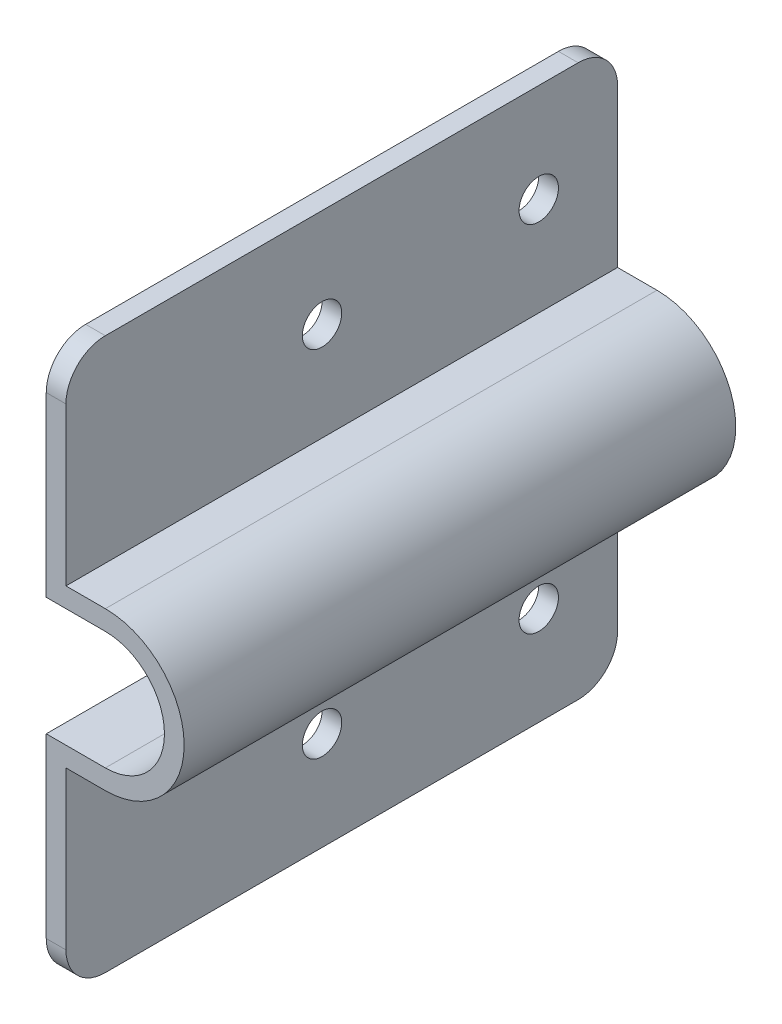
ISO-10303-21;
HEADER;
FILE_DESCRIPTION(('STEP AP214'),'2;1');
FILE_NAME('part.step','',(''),(''),'','','');
FILE_SCHEMA(('AUTOMOTIVE_DESIGN { 1 0 10303 214 1 1 1 1 }'));
ENDSEC;
DATA;
#1=APPLICATION_CONTEXT('core data for automotive mechanical design processes');
#2=APPLICATION_PROTOCOL_DEFINITION('international standard','automotive_design',2000,#1);
#3=PRODUCT_CONTEXT('',#1,'mechanical');
#4=PRODUCT('Part','Part','',(#3));
#5=PRODUCT_RELATED_PRODUCT_CATEGORY('part','',(#4));
#6=PRODUCT_DEFINITION_FORMATION('','',#4);
#7=PRODUCT_DEFINITION_CONTEXT('part definition',#1,'design');
#8=PRODUCT_DEFINITION('design','',#6,#7);
#9=PRODUCT_DEFINITION_SHAPE('','',#8);
#10=(LENGTH_UNIT() NAMED_UNIT(*) SI_UNIT(.MILLI.,.METRE.));
#11=(NAMED_UNIT(*) PLANE_ANGLE_UNIT() SI_UNIT($,.RADIAN.));
#12=(NAMED_UNIT(*) SI_UNIT($,.STERADIAN.) SOLID_ANGLE_UNIT());
#13=UNCERTAINTY_MEASURE_WITH_UNIT(LENGTH_MEASURE(1.E-05),#10,'distance_accuracy_value','');
#14=(GEOMETRIC_REPRESENTATION_CONTEXT(3) GLOBAL_UNCERTAINTY_ASSIGNED_CONTEXT((#13)) GLOBAL_UNIT_ASSIGNED_CONTEXT((#10,
#11,#12)) REPRESENTATION_CONTEXT('',''));
#15=CARTESIAN_POINT('',(0.,0.,0.));
#16=DIRECTION('',(0.,0.,1.));
#17=DIRECTION('',(1.,0.,0.));
#18=AXIS2_PLACEMENT_3D('',#15,#16,#17);
#19=CARTESIAN_POINT('',(0.,288.164397321974,-88.9));
#20=DIRECTION('',(0.,1.,0.));
#21=DIRECTION('',(0.,0.,1.));
#22=AXIS2_PLACEMENT_3D('',#19,#20,#21);
#23=PLANE('',#22);
#24=DIRECTION('',(-1.,0.,0.));
#25=VECTOR('',#24,1.);
#26=CARTESIAN_POINT('',(0.,288.164397321974,0.));
#27=LINE('',#26,#25);
#28=CARTESIAN_POINT('',(19.6849999999996,288.164397321974,0.));
#29=VERTEX_POINT('',#28);
#30=CARTESIAN_POINT('',(10.1599999999996,288.164397321974,0.));
#31=VERTEX_POINT('',#30);
#32=EDGE_CURVE('E223',#29,#31,#27,.T.);
#33=ORIENTED_EDGE('',*,*,#32,.T.);
#34=DIRECTION('',(0.,0.,1.));
#35=VECTOR('',#34,1.);
#36=CARTESIAN_POINT('',(10.1599999999996,288.164397321974,-88.9));
#37=LINE('',#36,#35);
#38=CARTESIAN_POINT('',(10.1599999999996,288.164397321974,-88.9));
#39=VERTEX_POINT('',#38);
#40=EDGE_CURVE('E184',#39,#31,#37,.T.);
#41=ORIENTED_EDGE('',*,*,#40,.F.);
#42=DIRECTION('',(-1.,0.,0.));
#43=VECTOR('',#42,1.);
#44=CARTESIAN_POINT('',(0.,288.164397321974,-88.9));
#45=LINE('',#44,#43);
#46=CARTESIAN_POINT('',(19.6849999999996,288.164397321974,-88.9));
#47=VERTEX_POINT('',#46);
#48=EDGE_CURVE('E163',#47,#39,#45,.T.);
#49=ORIENTED_EDGE('',*,*,#48,.F.);
#50=DIRECTION('',(0.,0.,1.));
#51=VECTOR('',#50,1.);
#52=CARTESIAN_POINT('',(19.6849999999996,288.164397321974,-88.9));
#53=LINE('',#52,#51);
#54=EDGE_CURVE('E172',#47,#29,#53,.T.);
#55=ORIENTED_EDGE('',*,*,#54,.T.);
#56=EDGE_LOOP('',(#33,#41,#49,#55));
#57=FACE_BOUND('',#56,.T.);
#58=ADVANCED_FACE('F42',(#57),#23,.F.);
#59=CARTESIAN_POINT('',(10.1599999999996,0.,-88.9));
#60=DIRECTION('',(-1.,0.,0.));
#61=DIRECTION('',(0.,-1.,0.));
#62=AXIS2_PLACEMENT_3D('',#59,#60,#61);
#63=PLANE('',#62);
#64=CARTESIAN_POINT('',(10.1599999999996,307.214397321974,-41.275));
#65=DIRECTION('',(1.,0.,0.));
#66=DIRECTION('',(0.,0.,-1.));
#67=AXIS2_PLACEMENT_3D('',#64,#65,#66);
#68=CIRCLE('',#67,3.175);
#69=CARTESIAN_POINT('',(10.1599999999996,307.214397321974,-44.45));
#70=VERTEX_POINT('',#69);
#71=EDGE_CURVE('E652',#70,#70,#68,.T.);
#72=ORIENTED_EDGE('',*,*,#71,.T.);
#73=EDGE_LOOP('',(#72));
#74=FACE_BOUND('',#73,.T.);
#75=CARTESIAN_POINT('',(10.1599999999996,307.214397321974,-76.2));
#76=DIRECTION('',(1.,0.,0.));
#77=DIRECTION('',(0.,0.,-1.));
#78=AXIS2_PLACEMENT_3D('',#75,#76,#77);
#79=CIRCLE('',#78,3.175);
#80=CARTESIAN_POINT('',(10.1599999999996,307.214397321974,-79.375));
#81=VERTEX_POINT('',#80);
#82=EDGE_CURVE('E651',#81,#81,#79,.T.);
#83=ORIENTED_EDGE('',*,*,#82,.T.);
#84=EDGE_LOOP('',(#83));
#85=FACE_BOUND('',#84,.T.);
#86=DIRECTION('',(0.,-1.,0.));
#87=VECTOR('',#86,1.);
#88=CARTESIAN_POINT('',(10.1599999999996,0.,0.));
#89=LINE('',#88,#87);
#90=CARTESIAN_POINT('',(10.1599999999996,316.739397321974,0.));
#91=VERTEX_POINT('',#90);
#92=EDGE_CURVE('E186',#91,#31,#89,.T.);
#93=ORIENTED_EDGE('',*,*,#92,.F.);
#94=CARTESIAN_POINT('',(10.1599999999996,316.739397321974,-6.34999999999999));
#95=DIRECTION('',(-1.,0.,0.));
#96=DIRECTION('',(0.,-1.,0.));
#97=AXIS2_PLACEMENT_3D('',#94,#95,#96);
#98=CIRCLE('',#97,6.35);
#99=CARTESIAN_POINT('',(10.1599999999996,323.089397321974,-6.34999999999999));
#100=VERTEX_POINT('',#99);
#101=EDGE_CURVE('E11',#91,#100,#98,.T.);
#102=ORIENTED_EDGE('',*,*,#101,.T.);
#103=DIRECTION('',(0.,0.,1.));
#104=VECTOR('',#103,1.);
#105=CARTESIAN_POINT('',(10.1599999999996,323.089397321974,-88.9));
#106=LINE('',#105,#104);
#107=CARTESIAN_POINT('',(10.1599999999996,323.089397321974,-82.55));
#108=VERTEX_POINT('',#107);
#109=EDGE_CURVE('E258',#108,#100,#106,.T.);
#110=ORIENTED_EDGE('',*,*,#109,.F.);
#111=CARTESIAN_POINT('',(10.1599999999996,316.739397321974,-82.55));
#112=DIRECTION('',(-1.,0.,0.));
#113=DIRECTION('',(0.,-1.,0.));
#114=AXIS2_PLACEMENT_3D('',#111,#112,#113);
#115=CIRCLE('',#114,6.35);
#116=CARTESIAN_POINT('',(10.1599999999996,316.739397321974,-88.9));
#117=VERTEX_POINT('',#116);
#118=EDGE_CURVE('E51',#108,#117,#115,.T.);
#119=ORIENTED_EDGE('',*,*,#118,.T.);
#120=DIRECTION('',(0.,-1.,0.));
#121=VECTOR('',#120,1.);
#122=CARTESIAN_POINT('',(10.1599999999996,0.,-88.9));
#123=LINE('',#122,#121);
#124=EDGE_CURVE('E181',#117,#39,#123,.T.);
#125=ORIENTED_EDGE('',*,*,#124,.T.);
#126=ORIENTED_EDGE('',*,*,#40,.T.);
#127=EDGE_LOOP('',(#93,#102,#110,#119,#125,#126));
#128=FACE_BOUND('',#127,.T.);
#129=ADVANCED_FACE('F336',(#74,#85,#128),#63,.T.);
#130=CARTESIAN_POINT('',(0.,323.089397321974,-88.9));
#131=DIRECTION('',(0.,-1.,0.));
#132=DIRECTION('',(0.,0.,-1.));
#133=AXIS2_PLACEMENT_3D('',#130,#131,#132);
#134=PLANE('',#133);
#135=ORIENTED_EDGE('',*,*,#109,.T.);
#136=DIRECTION('',(1.,0.,0.));
#137=VECTOR('',#136,1.);
#138=CARTESIAN_POINT('',(13.3349999999996,323.089397321974,-6.34999999999999));
#139=LINE('',#138,#137);
#140=CARTESIAN_POINT('',(13.3349999999996,323.089397321974,-6.34999999999999));
#141=VERTEX_POINT('',#140);
#142=EDGE_CURVE('E325',#100,#141,#139,.T.);
#143=ORIENTED_EDGE('',*,*,#142,.T.);
#144=DIRECTION('',(0.,0.,1.));
#145=VECTOR('',#144,1.);
#146=CARTESIAN_POINT('',(13.3349999999996,323.089397321974,-88.9));
#147=LINE('',#146,#145);
#148=CARTESIAN_POINT('',(13.3349999999996,323.089397321974,-82.55));
#149=VERTEX_POINT('',#148);
#150=EDGE_CURVE('E261',#149,#141,#147,.T.);
#151=ORIENTED_EDGE('',*,*,#150,.F.);
#152=DIRECTION('',(1.,0.,0.));
#153=VECTOR('',#152,1.);
#154=CARTESIAN_POINT('',(0.,323.089397321974,-82.55));
#155=LINE('',#154,#153);
#156=EDGE_CURVE('E63',#149,#108,#155,.F.);
#157=ORIENTED_EDGE('',*,*,#156,.T.);
#158=EDGE_LOOP('',(#135,#143,#151,#157));
#159=FACE_BOUND('',#158,.T.);
#160=ADVANCED_FACE('F342',(#159),#134,.F.);
#161=CARTESIAN_POINT('',(13.3349999999996,0.,-88.9));
#162=DIRECTION('',(1.,0.,0.));
#163=DIRECTION('',(0.,0.,-1.));
#164=AXIS2_PLACEMENT_3D('',#161,#162,#163);
#165=PLANE('',#164);
#166=CARTESIAN_POINT('',(13.3349999999996,307.214397321974,-41.275));
#167=DIRECTION('',(1.,0.,0.));
#168=DIRECTION('',(0.,0.,-1.));
#169=AXIS2_PLACEMENT_3D('',#166,#167,#168);
#170=CIRCLE('',#169,3.175);
#171=CARTESIAN_POINT('',(13.3349999999996,307.214397321974,-44.45));
#172=VERTEX_POINT('',#171);
#173=EDGE_CURVE('E645',#172,#172,#170,.T.);
#174=ORIENTED_EDGE('',*,*,#173,.F.);
#175=EDGE_LOOP('',(#174));
#176=FACE_BOUND('',#175,.T.);
#177=CARTESIAN_POINT('',(13.3349999999996,307.214397321974,-76.2));
#178=DIRECTION('',(1.,0.,0.));
#179=DIRECTION('',(0.,0.,-1.));
#180=AXIS2_PLACEMENT_3D('',#177,#178,#179);
#181=CIRCLE('',#180,3.175);
#182=CARTESIAN_POINT('',(13.3349999999996,307.214397321974,-79.375));
#183=VERTEX_POINT('',#182);
#184=EDGE_CURVE('E648',#183,#183,#181,.T.);
#185=ORIENTED_EDGE('',*,*,#184,.F.);
#186=EDGE_LOOP('',(#185));
#187=FACE_BOUND('',#186,.T.);
#188=ORIENTED_EDGE('',*,*,#150,.T.);
#189=CARTESIAN_POINT('',(13.3349999999996,316.739397321974,-6.34999999999999));
#190=DIRECTION('',(1.,0.,0.));
#191=DIRECTION('',(0.,0.,-1.));
#192=AXIS2_PLACEMENT_3D('',#189,#190,#191);
#193=CIRCLE('',#192,6.35);
#194=CARTESIAN_POINT('',(13.3349999999996,316.739397321974,0.));
#195=VERTEX_POINT('',#194);
#196=EDGE_CURVE('E331',#141,#195,#193,.T.);
#197=ORIENTED_EDGE('',*,*,#196,.T.);
#198=DIRECTION('',(0.,1.,0.));
#199=VECTOR('',#198,1.);
#200=CARTESIAN_POINT('',(13.3349999999996,0.,0.));
#201=LINE('',#200,#199);
#202=CARTESIAN_POINT('',(13.3349999999996,291.339397321974,0.));
#203=VERTEX_POINT('',#202);
#204=EDGE_CURVE('E190',#203,#195,#201,.T.);
#205=ORIENTED_EDGE('',*,*,#204,.F.);
#206=DIRECTION('',(0.,0.,1.));
#207=VECTOR('',#206,1.);
#208=CARTESIAN_POINT('',(13.3349999999996,291.339397321974,-88.9));
#209=LINE('',#208,#207);
#210=CARTESIAN_POINT('',(13.3349999999996,291.339397321974,-88.9));
#211=VERTEX_POINT('',#210);
#212=EDGE_CURVE('E265',#211,#203,#209,.T.);
#213=ORIENTED_EDGE('',*,*,#212,.F.);
#214=DIRECTION('',(0.,1.,0.));
#215=VECTOR('',#214,1.);
#216=CARTESIAN_POINT('',(13.3349999999996,0.,-88.9));
#217=LINE('',#216,#215);
#218=CARTESIAN_POINT('',(13.3349999999996,316.739397321974,-88.9));
#219=VERTEX_POINT('',#218);
#220=EDGE_CURVE('E217',#211,#219,#217,.T.);
#221=ORIENTED_EDGE('',*,*,#220,.T.);
#222=CARTESIAN_POINT('',(13.3349999999996,316.739397321974,-82.55));
#223=DIRECTION('',(1.,0.,0.));
#224=DIRECTION('',(0.,0.,-1.));
#225=AXIS2_PLACEMENT_3D('',#222,#223,#224);
#226=CIRCLE('',#225,6.35);
#227=EDGE_CURVE('E328',#219,#149,#226,.T.);
#228=ORIENTED_EDGE('',*,*,#227,.T.);
#229=EDGE_LOOP('',(#188,#197,#205,#213,#221,#228));
#230=FACE_BOUND('',#229,.T.);
#231=ADVANCED_FACE('F341',(#176,#187,#230),#165,.T.);
#232=CARTESIAN_POINT('',(0.,291.339397321974,-88.9));
#233=DIRECTION('',(0.,1.,0.));
#234=DIRECTION('',(0.,0.,1.));
#235=AXIS2_PLACEMENT_3D('',#232,#233,#234);
#236=PLANE('',#235);
#237=DIRECTION('',(-1.,0.,0.));
#238=VECTOR('',#237,1.);
#239=CARTESIAN_POINT('',(0.,291.339397321974,0.));
#240=LINE('',#239,#238);
#241=CARTESIAN_POINT('',(19.6849999999996,291.339397321974,0.));
#242=VERTEX_POINT('',#241);
#243=EDGE_CURVE('E248',#242,#203,#240,.T.);
#244=ORIENTED_EDGE('',*,*,#243,.F.);
#245=DIRECTION('',(0.,0.,1.));
#246=VECTOR('',#245,1.);
#247=CARTESIAN_POINT('',(19.6849999999996,291.339397321974,-88.9));
#248=LINE('',#247,#246);
#249=CARTESIAN_POINT('',(19.6849999999996,291.339397321974,-88.9));
#250=VERTEX_POINT('',#249);
#251=EDGE_CURVE('E268',#250,#242,#248,.T.);
#252=ORIENTED_EDGE('',*,*,#251,.F.);
#253=DIRECTION('',(-1.,0.,0.));
#254=VECTOR('',#253,1.);
#255=CARTESIAN_POINT('',(0.,291.339397321974,-88.9));
#256=LINE('',#255,#254);
#257=EDGE_CURVE('E213',#250,#211,#256,.T.);
#258=ORIENTED_EDGE('',*,*,#257,.T.);
#259=ORIENTED_EDGE('',*,*,#212,.T.);
#260=EDGE_LOOP('',(#244,#252,#258,#259));
#261=FACE_BOUND('',#260,.T.);
#262=ADVANCED_FACE('F354',(#261),#236,.T.);
#263=CARTESIAN_POINT('',(19.6849999999996,278.639397321974,-88.9));
#264=DIRECTION('',(0.,0.,1.));
#265=DIRECTION('',(1.,0.,0.));
#266=AXIS2_PLACEMENT_3D('',#263,#264,#265);
#267=CYLINDRICAL_SURFACE('',#266,12.7);
#268=CARTESIAN_POINT('',(19.6849999999996,278.639397321974,0.));
#269=DIRECTION('',(0.,0.,1.));
#270=DIRECTION('',(1.,0.,0.));
#271=AXIS2_PLACEMENT_3D('',#268,#269,#270);
#272=CIRCLE('',#271,12.7);
#273=CARTESIAN_POINT('',(19.6849999999996,265.939397321974,0.));
#274=VERTEX_POINT('',#273);
#275=EDGE_CURVE('E244',#274,#242,#272,.T.);
#276=ORIENTED_EDGE('',*,*,#275,.F.);
#277=DIRECTION('',(0.,0.,1.));
#278=VECTOR('',#277,1.);
#279=CARTESIAN_POINT('',(19.6849999999996,265.939397321974,-88.9));
#280=LINE('',#279,#278);
#281=CARTESIAN_POINT('',(19.6849999999996,265.939397321974,-88.9));
#282=VERTEX_POINT('',#281);
#283=EDGE_CURVE('E271',#282,#274,#280,.T.);
#284=ORIENTED_EDGE('',*,*,#283,.F.);
#285=CARTESIAN_POINT('',(19.6849999999996,278.639397321974,-88.9));
#286=DIRECTION('',(0.,0.,1.));
#287=DIRECTION('',(1.,0.,0.));
#288=AXIS2_PLACEMENT_3D('',#285,#286,#287);
#289=CIRCLE('',#288,12.7);
#290=EDGE_CURVE('E209',#282,#250,#289,.T.);
#291=ORIENTED_EDGE('',*,*,#290,.T.);
#292=ORIENTED_EDGE('',*,*,#251,.T.);
#293=EDGE_LOOP('',(#276,#284,#291,#292));
#294=FACE_BOUND('',#293,.T.);
#295=ADVANCED_FACE('F358',(#294),#267,.T.);
#296=CARTESIAN_POINT('',(0.,265.939397321974,-88.9));
#297=DIRECTION('',(0.,1.,0.));
#298=DIRECTION('',(0.,0.,1.));
#299=AXIS2_PLACEMENT_3D('',#296,#297,#298);
#300=PLANE('',#299);
#301=DIRECTION('',(-1.,0.,0.));
#302=VECTOR('',#301,1.);
#303=CARTESIAN_POINT('',(0.,265.939397321974,0.));
#304=LINE('',#303,#302);
#305=CARTESIAN_POINT('',(13.3349999999996,265.939397321974,0.));
#306=VERTEX_POINT('',#305);
#307=EDGE_CURVE('E240',#274,#306,#304,.T.);
#308=ORIENTED_EDGE('',*,*,#307,.T.);
#309=DIRECTION('',(0.,0.,1.));
#310=VECTOR('',#309,1.);
#311=CARTESIAN_POINT('',(13.3349999999996,265.939397321974,-88.9));
#312=LINE('',#311,#310);
#313=CARTESIAN_POINT('',(13.3349999999996,265.939397321974,-88.9));
#314=VERTEX_POINT('',#313);
#315=EDGE_CURVE('E274',#314,#306,#312,.T.);
#316=ORIENTED_EDGE('',*,*,#315,.F.);
#317=DIRECTION('',(-1.,0.,0.));
#318=VECTOR('',#317,1.);
#319=CARTESIAN_POINT('',(0.,265.939397321974,-88.9));
#320=LINE('',#319,#318);
#321=EDGE_CURVE('E205',#282,#314,#320,.T.);
#322=ORIENTED_EDGE('',*,*,#321,.F.);
#323=ORIENTED_EDGE('',*,*,#283,.T.);
#324=EDGE_LOOP('',(#308,#316,#322,#323));
#325=FACE_BOUND('',#324,.T.);
#326=ADVANCED_FACE('F362',(#325),#300,.F.);
#327=CARTESIAN_POINT('',(13.3349999999996,0.,-88.9));
#328=DIRECTION('',(1.,0.,0.));
#329=DIRECTION('',(0.,0.,-1.));
#330=AXIS2_PLACEMENT_3D('',#327,#328,#329);
#331=PLANE('',#330);
#332=CARTESIAN_POINT('',(13.3349999999996,250.064397321974,-76.2));
#333=DIRECTION('',(1.,0.,0.));
#334=DIRECTION('',(0.,0.,-1.));
#335=AXIS2_PLACEMENT_3D('',#332,#333,#334);
#336=CIRCLE('',#335,3.175);
#337=CARTESIAN_POINT('',(13.3349999999996,250.064397321974,-79.375));
#338=VERTEX_POINT('',#337);
#339=EDGE_CURVE('E656',#338,#338,#336,.T.);
#340=ORIENTED_EDGE('',*,*,#339,.F.);
#341=EDGE_LOOP('',(#340));
#342=FACE_BOUND('',#341,.T.);
#343=CARTESIAN_POINT('',(13.3349999999996,250.064397321974,-41.275));
#344=DIRECTION('',(1.,0.,0.));
#345=DIRECTION('',(0.,0.,-1.));
#346=AXIS2_PLACEMENT_3D('',#343,#344,#345);
#347=CIRCLE('',#346,3.175);
#348=CARTESIAN_POINT('',(13.3349999999996,250.064397321974,-44.45));
#349=VERTEX_POINT('',#348);
#350=EDGE_CURVE('E193',#349,#349,#347,.T.);
#351=ORIENTED_EDGE('',*,*,#350,.F.);
#352=EDGE_LOOP('',(#351));
#353=FACE_BOUND('',#352,.T.);
#354=DIRECTION('',(0.,1.,0.));
#355=VECTOR('',#354,1.);
#356=CARTESIAN_POINT('',(13.3349999999996,0.,0.));
#357=LINE('',#356,#355);
#358=CARTESIAN_POINT('',(13.3349999999996,240.539397321974,0.));
#359=VERTEX_POINT('',#358);
#360=EDGE_CURVE('E237',#359,#306,#357,.T.);
#361=ORIENTED_EDGE('',*,*,#360,.F.);
#362=CARTESIAN_POINT('',(13.3349999999996,240.539397321974,-6.35));
#363=DIRECTION('',(1.,0.,0.));
#364=DIRECTION('',(0.,0.,-1.));
#365=AXIS2_PLACEMENT_3D('',#362,#363,#364);
#366=CIRCLE('',#365,6.35);
#367=CARTESIAN_POINT('',(13.3349999999996,234.189397321974,-6.34999999999999));
#368=VERTEX_POINT('',#367);
#369=EDGE_CURVE('E300',#359,#368,#366,.T.);
#370=ORIENTED_EDGE('',*,*,#369,.T.);
#371=DIRECTION('',(0.,0.,1.));
#372=VECTOR('',#371,1.);
#373=CARTESIAN_POINT('',(13.3349999999996,234.189397321974,-88.9));
#374=LINE('',#373,#372);
#375=CARTESIAN_POINT('',(13.3349999999996,234.189397321974,-82.55));
#376=VERTEX_POINT('',#375);
#377=EDGE_CURVE('E278',#376,#368,#374,.T.);
#378=ORIENTED_EDGE('',*,*,#377,.F.);
#379=CARTESIAN_POINT('',(13.3349999999996,240.539397321974,-82.55));
#380=DIRECTION('',(1.,0.,0.));
#381=DIRECTION('',(0.,0.,-1.));
#382=AXIS2_PLACEMENT_3D('',#379,#380,#381);
#383=CIRCLE('',#382,6.35);
#384=CARTESIAN_POINT('',(13.3349999999996,240.539397321974,-88.9));
#385=VERTEX_POINT('',#384);
#386=EDGE_CURVE('E297',#376,#385,#383,.T.);
#387=ORIENTED_EDGE('',*,*,#386,.T.);
#388=DIRECTION('',(0.,1.,0.));
#389=VECTOR('',#388,1.);
#390=CARTESIAN_POINT('',(13.3349999999996,0.,-88.9));
#391=LINE('',#390,#389);
#392=EDGE_CURVE('E202',#385,#314,#391,.T.);
#393=ORIENTED_EDGE('',*,*,#392,.T.);
#394=ORIENTED_EDGE('',*,*,#315,.T.);
#395=EDGE_LOOP('',(#361,#370,#378,#387,#393,#394));
#396=FACE_BOUND('',#395,.T.);
#397=ADVANCED_FACE('F496',(#342,#353,#396),#331,.T.);
#398=CARTESIAN_POINT('',(0.,234.189397321974,-88.9));
#399=DIRECTION('',(0.,-1.,0.));
#400=DIRECTION('',(0.,0.,-1.));
#401=AXIS2_PLACEMENT_3D('',#398,#399,#400);
#402=PLANE('',#401);
#403=ORIENTED_EDGE('',*,*,#377,.T.);
#404=DIRECTION('',(1.,0.,0.));
#405=VECTOR('',#404,1.);
#406=CARTESIAN_POINT('',(0.,234.189397321974,-6.34999999999999));
#407=LINE('',#406,#405);
#408=CARTESIAN_POINT('',(10.1599999999996,234.189397321974,-6.34999999999999));
#409=VERTEX_POINT('',#408);
#410=EDGE_CURVE('E307',#368,#409,#407,.F.);
#411=ORIENTED_EDGE('',*,*,#410,.T.);
#412=DIRECTION('',(0.,0.,1.));
#413=VECTOR('',#412,1.);
#414=CARTESIAN_POINT('',(10.1599999999996,234.189397321974,-88.9));
#415=LINE('',#414,#413);
#416=CARTESIAN_POINT('',(10.1599999999996,234.189397321974,-82.55));
#417=VERTEX_POINT('',#416);
#418=EDGE_CURVE('E282',#417,#409,#415,.T.);
#419=ORIENTED_EDGE('',*,*,#418,.F.);
#420=DIRECTION('',(1.,0.,0.));
#421=VECTOR('',#420,1.);
#422=CARTESIAN_POINT('',(13.3349999999996,234.189397321974,-82.55));
#423=LINE('',#422,#421);
#424=EDGE_CURVE('E303',#417,#376,#423,.T.);
#425=ORIENTED_EDGE('',*,*,#424,.T.);
#426=EDGE_LOOP('',(#403,#411,#419,#425));
#427=FACE_BOUND('',#426,.T.);
#428=ADVANCED_FACE('F374',(#427),#402,.T.);
#429=CARTESIAN_POINT('',(10.1599999999996,0.,-88.9));
#430=DIRECTION('',(-1.,0.,0.));
#431=DIRECTION('',(0.,-1.,0.));
#432=AXIS2_PLACEMENT_3D('',#429,#430,#431);
#433=PLANE('',#432);
#434=CARTESIAN_POINT('',(10.1599999999996,250.064397321974,-76.2));
#435=DIRECTION('',(1.,0.,0.));
#436=DIRECTION('',(0.,0.,-1.));
#437=AXIS2_PLACEMENT_3D('',#434,#435,#436);
#438=CIRCLE('',#437,3.175);
#439=CARTESIAN_POINT('',(10.1599999999996,250.064397321974,-79.375));
#440=VERTEX_POINT('',#439);
#441=EDGE_CURVE('E671',#440,#440,#438,.T.);
#442=ORIENTED_EDGE('',*,*,#441,.T.);
#443=EDGE_LOOP('',(#442));
#444=FACE_BOUND('',#443,.T.);
#445=CARTESIAN_POINT('',(10.1599999999996,250.064397321974,-41.275));
#446=DIRECTION('',(1.,0.,0.));
#447=DIRECTION('',(0.,0.,-1.));
#448=AXIS2_PLACEMENT_3D('',#445,#446,#447);
#449=CIRCLE('',#448,3.175);
#450=CARTESIAN_POINT('',(10.1599999999996,250.064397321974,-44.45));
#451=VERTEX_POINT('',#450);
#452=EDGE_CURVE('E226',#451,#451,#449,.T.);
#453=ORIENTED_EDGE('',*,*,#452,.T.);
#454=EDGE_LOOP('',(#453));
#455=FACE_BOUND('',#454,.T.);
#456=ORIENTED_EDGE('',*,*,#418,.T.);
#457=CARTESIAN_POINT('',(10.1599999999996,240.539397321974,-6.35));
#458=DIRECTION('',(-1.,0.,0.));
#459=DIRECTION('',(0.,-1.,0.));
#460=AXIS2_PLACEMENT_3D('',#457,#458,#459);
#461=CIRCLE('',#460,6.35);
#462=CARTESIAN_POINT('',(10.1599999999996,240.539397321974,0.));
#463=VERTEX_POINT('',#462);
#464=EDGE_CURVE('E313',#409,#463,#461,.T.);
#465=ORIENTED_EDGE('',*,*,#464,.T.);
#466=DIRECTION('',(0.,-1.,0.));
#467=VECTOR('',#466,1.);
#468=CARTESIAN_POINT('',(10.1599999999996,0.,0.));
#469=LINE('',#468,#467);
#470=CARTESIAN_POINT('',(10.1599999999996,269.114397321974,0.));
#471=VERTEX_POINT('',#470);
#472=EDGE_CURVE('E233',#471,#463,#469,.T.);
#473=ORIENTED_EDGE('',*,*,#472,.F.);
#474=DIRECTION('',(0.,0.,1.));
#475=VECTOR('',#474,1.);
#476=CARTESIAN_POINT('',(10.1599999999996,269.114397321974,-88.9));
#477=LINE('',#476,#475);
#478=CARTESIAN_POINT('',(10.1599999999996,269.114397321974,-88.9));
#479=VERTEX_POINT('',#478);
#480=EDGE_CURVE('E286',#479,#471,#477,.T.);
#481=ORIENTED_EDGE('',*,*,#480,.F.);
#482=DIRECTION('',(0.,-1.,0.));
#483=VECTOR('',#482,1.);
#484=CARTESIAN_POINT('',(10.1599999999996,0.,-88.9));
#485=LINE('',#484,#483);
#486=CARTESIAN_POINT('',(10.1599999999996,240.539397321974,-88.9));
#487=VERTEX_POINT('',#486);
#488=EDGE_CURVE('E198',#479,#487,#485,.T.);
#489=ORIENTED_EDGE('',*,*,#488,.T.);
#490=CARTESIAN_POINT('',(10.1599999999996,240.539397321974,-82.55));
#491=DIRECTION('',(-1.,0.,0.));
#492=DIRECTION('',(0.,-1.,0.));
#493=AXIS2_PLACEMENT_3D('',#490,#491,#492);
#494=CIRCLE('',#493,6.35);
#495=EDGE_CURVE('E310',#487,#417,#494,.T.);
#496=ORIENTED_EDGE('',*,*,#495,.T.);
#497=EDGE_LOOP('',(#456,#465,#473,#481,#489,#496));
#498=FACE_BOUND('',#497,.T.);
#499=ADVANCED_FACE('F371',(#444,#455,#498),#433,.T.);
#500=CARTESIAN_POINT('',(0.,269.114397321974,-88.9));
#501=DIRECTION('',(0.,1.,0.));
#502=DIRECTION('',(0.,0.,1.));
#503=AXIS2_PLACEMENT_3D('',#500,#501,#502);
#504=PLANE('',#503);
#505=DIRECTION('',(-1.,0.,0.));
#506=VECTOR('',#505,1.);
#507=CARTESIAN_POINT('',(0.,269.114397321974,0.));
#508=LINE('',#507,#506);
#509=CARTESIAN_POINT('',(19.6849999999996,269.114397321974,0.));
#510=VERTEX_POINT('',#509);
#511=EDGE_CURVE('E229',#510,#471,#508,.T.);
#512=ORIENTED_EDGE('',*,*,#511,.F.);
#513=DIRECTION('',(0.,0.,1.));
#514=VECTOR('',#513,1.);
#515=CARTESIAN_POINT('',(19.6849999999996,269.114397321974,-88.9));
#516=LINE('',#515,#514);
#517=CARTESIAN_POINT('',(19.6849999999996,269.114397321974,-88.9));
#518=VERTEX_POINT('',#517);
#519=EDGE_CURVE('E180',#518,#510,#516,.T.);
#520=ORIENTED_EDGE('',*,*,#519,.F.);
#521=DIRECTION('',(-1.,0.,0.));
#522=VECTOR('',#521,1.);
#523=CARTESIAN_POINT('',(0.,269.114397321974,-88.9));
#524=LINE('',#523,#522);
#525=EDGE_CURVE('E167',#518,#479,#524,.T.);
#526=ORIENTED_EDGE('',*,*,#525,.T.);
#527=ORIENTED_EDGE('',*,*,#480,.T.);
#528=EDGE_LOOP('',(#512,#520,#526,#527));
#529=FACE_BOUND('',#528,.T.);
#530=ADVANCED_FACE('F384',(#529),#504,.T.);
#531=CARTESIAN_POINT('',(19.6849999999996,278.639397321974,-88.9));
#532=DIRECTION('',(0.,0.,1.));
#533=DIRECTION('',(1.,0.,0.));
#534=AXIS2_PLACEMENT_3D('',#531,#532,#533);
#535=CYLINDRICAL_SURFACE('',#534,9.525);
#536=CARTESIAN_POINT('',(19.6849999999996,278.639397321974,0.));
#537=DIRECTION('',(0.,0.,1.));
#538=DIRECTION('',(1.,0.,0.));
#539=AXIS2_PLACEMENT_3D('',#536,#537,#538);
#540=CIRCLE('',#539,9.525);
#541=EDGE_CURVE('E175',#510,#29,#540,.T.);
#542=ORIENTED_EDGE('',*,*,#541,.T.);
#543=ORIENTED_EDGE('',*,*,#54,.F.);
#544=CARTESIAN_POINT('',(19.6849999999996,278.639397321974,-88.9));
#545=DIRECTION('',(0.,0.,1.));
#546=DIRECTION('',(1.,0.,0.));
#547=AXIS2_PLACEMENT_3D('',#544,#545,#546);
#548=CIRCLE('',#547,9.525);
#549=EDGE_CURVE('E157',#518,#47,#548,.T.);
#550=ORIENTED_EDGE('',*,*,#549,.F.);
#551=ORIENTED_EDGE('',*,*,#519,.T.);
#552=EDGE_LOOP('',(#542,#543,#550,#551));
#553=FACE_BOUND('',#552,.T.);
#554=ADVANCED_FACE('F173',(#553),#535,.F.);
#555=CARTESIAN_POINT('',(0.,0.,-88.9));
#556=DIRECTION('',(0.,0.,1.));
#557=DIRECTION('',(1.,0.,0.));
#558=AXIS2_PLACEMENT_3D('',#555,#556,#557);
#559=PLANE('',#558);
#560=ORIENTED_EDGE('',*,*,#392,.F.);
#561=DIRECTION('',(1.,0.,0.));
#562=VECTOR('',#561,1.);
#563=CARTESIAN_POINT('',(10.1599999999996,240.539397321974,-88.9));
#564=LINE('',#563,#562);
#565=EDGE_CURVE('E320',#385,#487,#564,.F.);
#566=ORIENTED_EDGE('',*,*,#565,.T.);
#567=ORIENTED_EDGE('',*,*,#488,.F.);
#568=ORIENTED_EDGE('',*,*,#525,.F.);
#569=ORIENTED_EDGE('',*,*,#549,.T.);
#570=ORIENTED_EDGE('',*,*,#48,.T.);
#571=ORIENTED_EDGE('',*,*,#124,.F.);
#572=DIRECTION('',(1.,0.,0.));
#573=VECTOR('',#572,1.);
#574=CARTESIAN_POINT('',(0.,316.739397321974,-88.9));
#575=LINE('',#574,#573);
#576=EDGE_CURVE('E316',#117,#219,#575,.T.);
#577=ORIENTED_EDGE('',*,*,#576,.T.);
#578=ORIENTED_EDGE('',*,*,#220,.F.);
#579=ORIENTED_EDGE('',*,*,#257,.F.);
#580=ORIENTED_EDGE('',*,*,#290,.F.);
#581=ORIENTED_EDGE('',*,*,#321,.T.);
#582=EDGE_LOOP('',(#560,#566,#567,#568,#569,#570,#571,#577,#578,#579,#580,#581));
#583=FACE_BOUND('',#582,.T.);
#584=ADVANCED_FACE('F160',(#583),#559,.F.);
#585=CARTESIAN_POINT('',(0.,0.,0.));
#586=DIRECTION('',(0.,0.,1.));
#587=DIRECTION('',(1.,0.,0.));
#588=AXIS2_PLACEMENT_3D('',#585,#586,#587);
#589=PLANE('',#588);
#590=ORIENTED_EDGE('',*,*,#472,.T.);
#591=DIRECTION('',(1.,0.,0.));
#592=VECTOR('',#591,1.);
#593=CARTESIAN_POINT('',(0.,240.539397321974,0.));
#594=LINE('',#593,#592);
#595=EDGE_CURVE('E293',#463,#359,#594,.T.);
#596=ORIENTED_EDGE('',*,*,#595,.T.);
#597=ORIENTED_EDGE('',*,*,#360,.T.);
#598=ORIENTED_EDGE('',*,*,#307,.F.);
#599=ORIENTED_EDGE('',*,*,#275,.T.);
#600=ORIENTED_EDGE('',*,*,#243,.T.);
#601=ORIENTED_EDGE('',*,*,#204,.T.);
#602=DIRECTION('',(1.,0.,0.));
#603=VECTOR('',#602,1.);
#604=CARTESIAN_POINT('',(10.1599999999996,316.739397321974,0.));
#605=LINE('',#604,#603);
#606=EDGE_CURVE('E257',#195,#91,#605,.F.);
#607=ORIENTED_EDGE('',*,*,#606,.T.);
#608=ORIENTED_EDGE('',*,*,#92,.T.);
#609=ORIENTED_EDGE('',*,*,#32,.F.);
#610=ORIENTED_EDGE('',*,*,#541,.F.);
#611=ORIENTED_EDGE('',*,*,#511,.T.);
#612=EDGE_LOOP('',(#590,#596,#597,#598,#599,#600,#601,#607,#608,#609,#610,#611));
#613=FACE_BOUND('',#612,.T.);
#614=ADVANCED_FACE('F349',(#613),#589,.T.);
#615=CARTESIAN_POINT('',(10.1599999999996,250.064397321974,-41.275));
#616=DIRECTION('',(1.,0.,0.));
#617=DIRECTION('',(0.,0.,-1.));
#618=AXIS2_PLACEMENT_3D('',#615,#616,#617);
#619=CYLINDRICAL_SURFACE('',#618,3.175);
#620=ORIENTED_EDGE('',*,*,#452,.F.);
#621=EDGE_LOOP('',(#620));
#622=FACE_BOUND('',#621,.T.);
#623=ORIENTED_EDGE('',*,*,#350,.T.);
#624=EDGE_LOOP('',(#623));
#625=FACE_BOUND('',#624,.T.);
#626=ADVANCED_FACE('F452',(#622,#625),#619,.F.);
#627=CARTESIAN_POINT('',(10.1599999999996,250.064397321974,-76.2));
#628=DIRECTION('',(1.,0.,0.));
#629=DIRECTION('',(0.,0.,-1.));
#630=AXIS2_PLACEMENT_3D('',#627,#628,#629);
#631=CYLINDRICAL_SURFACE('',#630,3.175);
#632=ORIENTED_EDGE('',*,*,#441,.F.);
#633=EDGE_LOOP('',(#632));
#634=FACE_BOUND('',#633,.T.);
#635=ORIENTED_EDGE('',*,*,#339,.T.);
#636=EDGE_LOOP('',(#635));
#637=FACE_BOUND('',#636,.T.);
#638=ADVANCED_FACE('F443',(#634,#637),#631,.F.);
#639=CARTESIAN_POINT('',(10.1599999999996,307.214397321974,-76.2));
#640=DIRECTION('',(1.,0.,0.));
#641=DIRECTION('',(0.,0.,-1.));
#642=AXIS2_PLACEMENT_3D('',#639,#640,#641);
#643=CYLINDRICAL_SURFACE('',#642,3.175);
#644=ORIENTED_EDGE('',*,*,#82,.F.);
#645=EDGE_LOOP('',(#644));
#646=FACE_BOUND('',#645,.T.);
#647=ORIENTED_EDGE('',*,*,#184,.T.);
#648=EDGE_LOOP('',(#647));
#649=FACE_BOUND('',#648,.T.);
#650=ADVANCED_FACE('F433',(#646,#649),#643,.F.);
#651=CARTESIAN_POINT('',(10.1599999999996,307.214397321974,-41.275));
#652=DIRECTION('',(1.,0.,0.));
#653=DIRECTION('',(0.,0.,-1.));
#654=AXIS2_PLACEMENT_3D('',#651,#652,#653);
#655=CYLINDRICAL_SURFACE('',#654,3.175);
#656=ORIENTED_EDGE('',*,*,#71,.F.);
#657=EDGE_LOOP('',(#656));
#658=FACE_BOUND('',#657,.T.);
#659=ORIENTED_EDGE('',*,*,#173,.T.);
#660=EDGE_LOOP('',(#659));
#661=FACE_BOUND('',#660,.T.);
#662=ADVANCED_FACE('F404',(#658,#661),#655,.F.);
#663=CARTESIAN_POINT('',(0.,240.539397321974,-6.35));
#664=DIRECTION('',(1.,0.,0.));
#665=DIRECTION('',(0.,0.,-1.));
#666=AXIS2_PLACEMENT_3D('',#663,#664,#665);
#667=CYLINDRICAL_SURFACE('',#666,6.35);
#668=ORIENTED_EDGE('',*,*,#464,.F.);
#669=ORIENTED_EDGE('',*,*,#410,.F.);
#670=ORIENTED_EDGE('',*,*,#369,.F.);
#671=ORIENTED_EDGE('',*,*,#595,.F.);
#672=EDGE_LOOP('',(#668,#669,#670,#671));
#673=FACE_BOUND('',#672,.T.);
#674=ADVANCED_FACE('F378',(#673),#667,.T.);
#675=CARTESIAN_POINT('',(0.,240.539397321974,-82.55));
#676=DIRECTION('',(-1.,0.,0.));
#677=DIRECTION('',(0.,0.,1.));
#678=AXIS2_PLACEMENT_3D('',#675,#676,#677);
#679=CYLINDRICAL_SURFACE('',#678,6.35);
#680=ORIENTED_EDGE('',*,*,#495,.F.);
#681=ORIENTED_EDGE('',*,*,#565,.F.);
#682=ORIENTED_EDGE('',*,*,#386,.F.);
#683=ORIENTED_EDGE('',*,*,#424,.F.);
#684=EDGE_LOOP('',(#680,#681,#682,#683));
#685=FACE_BOUND('',#684,.T.);
#686=ADVANCED_FACE('F367',(#685),#679,.T.);
#687=CARTESIAN_POINT('',(0.,316.739397321974,-6.34999999999999));
#688=DIRECTION('',(-1.,0.,0.));
#689=DIRECTION('',(0.,0.,1.));
#690=AXIS2_PLACEMENT_3D('',#687,#688,#689);
#691=CYLINDRICAL_SURFACE('',#690,6.35);
#692=ORIENTED_EDGE('',*,*,#101,.F.);
#693=ORIENTED_EDGE('',*,*,#606,.F.);
#694=ORIENTED_EDGE('',*,*,#196,.F.);
#695=ORIENTED_EDGE('',*,*,#142,.F.);
#696=EDGE_LOOP('',(#692,#693,#694,#695));
#697=FACE_BOUND('',#696,.T.);
#698=ADVANCED_FACE('F345',(#697),#691,.T.);
#699=CARTESIAN_POINT('',(0.,316.739397321974,-82.55));
#700=DIRECTION('',(1.,0.,0.));
#701=DIRECTION('',(0.,0.,-1.));
#702=AXIS2_PLACEMENT_3D('',#699,#700,#701);
#703=CYLINDRICAL_SURFACE('',#702,6.35);
#704=ORIENTED_EDGE('',*,*,#118,.F.);
#705=ORIENTED_EDGE('',*,*,#156,.F.);
#706=ORIENTED_EDGE('',*,*,#227,.F.);
#707=ORIENTED_EDGE('',*,*,#576,.F.);
#708=EDGE_LOOP('',(#704,#705,#706,#707));
#709=FACE_BOUND('',#708,.T.);
#710=ADVANCED_FACE('F44',(#709),#703,.T.);
#711=CLOSED_SHELL('',(#58,#129,#160,#231,#262,#295,#326,#397,#428,#499,#530,#554,#584,#614,#626,
#638,#650,#662,#674,#686,#698,#710));
#712=MANIFOLD_SOLID_BREP('B2',#711);
#713=ADVANCED_BREP_SHAPE_REPRESENTATION('',(#18,#712),#14);
#714=SHAPE_DEFINITION_REPRESENTATION(#9,#713);
ENDSEC;
END-ISO-10303-21;
